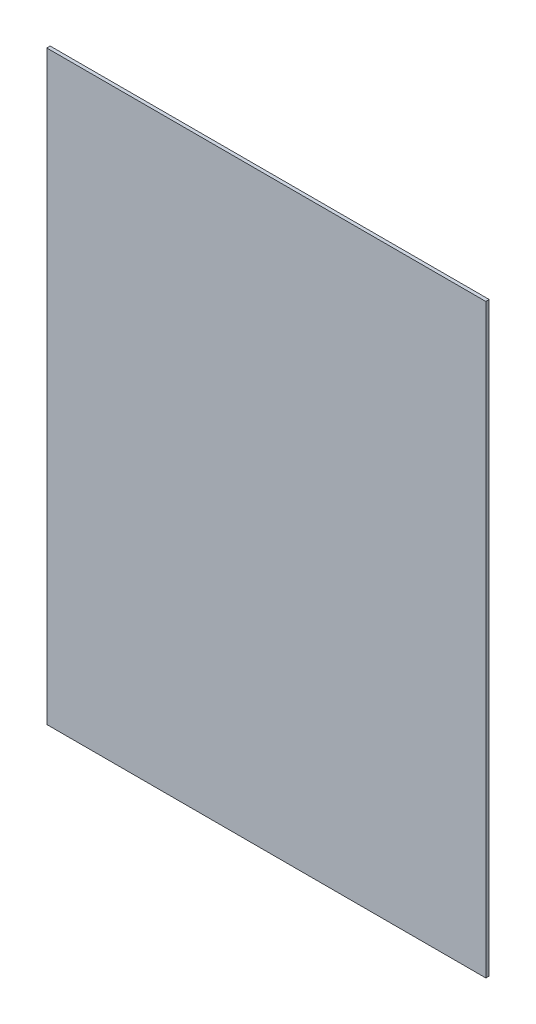
ISO-10303-21;
HEADER;
FILE_DESCRIPTION(('STEP AP214'),'2;1');
FILE_NAME('part.step','',(''),(''),'','','');
FILE_SCHEMA(('AUTOMOTIVE_DESIGN { 1 0 10303 214 1 1 1 1 }'));
ENDSEC;
DATA;
#1=APPLICATION_CONTEXT('core data for automotive mechanical design processes');
#2=APPLICATION_PROTOCOL_DEFINITION('international standard','automotive_design',2000,#1);
#3=PRODUCT_CONTEXT('',#1,'mechanical');
#4=PRODUCT('Part','Part','',(#3));
#5=PRODUCT_RELATED_PRODUCT_CATEGORY('part','',(#4));
#6=PRODUCT_DEFINITION_FORMATION('','',#4);
#7=PRODUCT_DEFINITION_CONTEXT('part definition',#1,'design');
#8=PRODUCT_DEFINITION('design','',#6,#7);
#9=PRODUCT_DEFINITION_SHAPE('','',#8);
#10=(LENGTH_UNIT() NAMED_UNIT(*) SI_UNIT(.MILLI.,.METRE.));
#11=(NAMED_UNIT(*) PLANE_ANGLE_UNIT() SI_UNIT($,.RADIAN.));
#12=(NAMED_UNIT(*) SI_UNIT($,.STERADIAN.) SOLID_ANGLE_UNIT());
#13=UNCERTAINTY_MEASURE_WITH_UNIT(LENGTH_MEASURE(1.E-05),#10,'distance_accuracy_value','');
#14=(GEOMETRIC_REPRESENTATION_CONTEXT(3) GLOBAL_UNCERTAINTY_ASSIGNED_CONTEXT((#13)) GLOBAL_UNIT_ASSIGNED_CONTEXT((#10,
#11,#12)) REPRESENTATION_CONTEXT('',''));
#15=CARTESIAN_POINT('',(0.,0.,0.));
#16=DIRECTION('',(0.,0.,1.));
#17=DIRECTION('',(1.,0.,0.));
#18=AXIS2_PLACEMENT_3D('',#15,#16,#17);
#19=CARTESIAN_POINT('',(77.,-102.75,1.190625));
#20=DIRECTION('',(-1.,0.,0.));
#21=DIRECTION('',(0.,0.,1.));
#22=AXIS2_PLACEMENT_3D('',#19,#20,#21);
#23=PLANE('',#22);
#24=DIRECTION('',(0.,1.,0.));
#25=VECTOR('',#24,1.);
#26=CARTESIAN_POINT('',(77.,-102.75,0.));
#27=LINE('',#26,#25);
#28=CARTESIAN_POINT('',(77.,-102.75,0.));
#29=VERTEX_POINT('',#28);
#30=CARTESIAN_POINT('',(77.,102.75,0.));
#31=VERTEX_POINT('',#30);
#32=EDGE_CURVE('E100',#29,#31,#27,.T.);
#33=ORIENTED_EDGE('',*,*,#32,.T.);
#34=DIRECTION('',(0.,0.,-1.));
#35=VECTOR('',#34,1.);
#36=CARTESIAN_POINT('',(77.,102.75,1.190625));
#37=LINE('',#36,#35);
#38=CARTESIAN_POINT('',(77.,102.75,1.190625));
#39=VERTEX_POINT('',#38);
#40=EDGE_CURVE('E11',#39,#31,#37,.T.);
#41=ORIENTED_EDGE('',*,*,#40,.F.);
#42=DIRECTION('',(0.,1.,0.));
#43=VECTOR('',#42,1.);
#44=CARTESIAN_POINT('',(77.,-102.75,1.190625));
#45=LINE('',#44,#43);
#46=CARTESIAN_POINT('',(77.,-102.75,1.190625));
#47=VERTEX_POINT('',#46);
#48=EDGE_CURVE('E88',#47,#39,#45,.T.);
#49=ORIENTED_EDGE('',*,*,#48,.F.);
#50=DIRECTION('',(0.,0.,-1.));
#51=VECTOR('',#50,1.);
#52=CARTESIAN_POINT('',(77.,-102.75,1.190625));
#53=LINE('',#52,#51);
#54=EDGE_CURVE('E96',#47,#29,#53,.T.);
#55=ORIENTED_EDGE('',*,*,#54,.T.);
#56=EDGE_LOOP('',(#33,#41,#49,#55));
#57=FACE_BOUND('',#56,.T.);
#58=ADVANCED_FACE('F37',(#57),#23,.F.);
#59=CARTESIAN_POINT('',(-77.,102.75,1.190625));
#60=DIRECTION('',(0.,-1.,0.));
#61=DIRECTION('',(0.,0.,-1.));
#62=AXIS2_PLACEMENT_3D('',#59,#60,#61);
#63=PLANE('',#62);
#64=DIRECTION('',(-1.,0.,0.));
#65=VECTOR('',#64,1.);
#66=CARTESIAN_POINT('',(-77.,102.75,0.));
#67=LINE('',#66,#65);
#68=CARTESIAN_POINT('',(-77.,102.75,0.));
#69=VERTEX_POINT('',#68);
#70=EDGE_CURVE('E92',#31,#69,#67,.T.);
#71=ORIENTED_EDGE('',*,*,#70,.T.);
#72=DIRECTION('',(0.,0.,-1.));
#73=VECTOR('',#72,1.);
#74=CARTESIAN_POINT('',(-77.,102.75,1.190625));
#75=LINE('',#74,#73);
#76=CARTESIAN_POINT('',(-77.,102.75,1.190625));
#77=VERTEX_POINT('',#76);
#78=EDGE_CURVE('E45',#77,#69,#75,.T.);
#79=ORIENTED_EDGE('',*,*,#78,.F.);
#80=DIRECTION('',(-1.,0.,0.));
#81=VECTOR('',#80,1.);
#82=CARTESIAN_POINT('',(-77.,102.75,1.190625));
#83=LINE('',#82,#81);
#84=EDGE_CURVE('E83',#39,#77,#83,.T.);
#85=ORIENTED_EDGE('',*,*,#84,.F.);
#86=ORIENTED_EDGE('',*,*,#40,.T.);
#87=EDGE_LOOP('',(#71,#79,#85,#86));
#88=FACE_BOUND('',#87,.T.);
#89=ADVANCED_FACE('F91',(#88),#63,.F.);
#90=CARTESIAN_POINT('',(-77.,-102.75,1.190625));
#91=DIRECTION('',(1.,0.,0.));
#92=DIRECTION('',(0.,0.,-1.));
#93=AXIS2_PLACEMENT_3D('',#90,#91,#92);
#94=PLANE('',#93);
#95=DIRECTION('',(0.,-1.,0.));
#96=VECTOR('',#95,1.);
#97=CARTESIAN_POINT('',(-77.,-102.75,0.));
#98=LINE('',#97,#96);
#99=CARTESIAN_POINT('',(-77.,-102.75,0.));
#100=VERTEX_POINT('',#99);
#101=EDGE_CURVE('E70',#69,#100,#98,.T.);
#102=ORIENTED_EDGE('',*,*,#101,.T.);
#103=DIRECTION('',(0.,0.,-1.));
#104=VECTOR('',#103,1.);
#105=CARTESIAN_POINT('',(-77.,-102.75,1.190625));
#106=LINE('',#105,#104);
#107=CARTESIAN_POINT('',(-77.,-102.75,1.190625));
#108=VERTEX_POINT('',#107);
#109=EDGE_CURVE('E93',#108,#100,#106,.T.);
#110=ORIENTED_EDGE('',*,*,#109,.F.);
#111=DIRECTION('',(0.,-1.,0.));
#112=VECTOR('',#111,1.);
#113=CARTESIAN_POINT('',(-77.,-102.75,1.190625));
#114=LINE('',#113,#112);
#115=EDGE_CURVE('E86',#77,#108,#114,.T.);
#116=ORIENTED_EDGE('',*,*,#115,.F.);
#117=ORIENTED_EDGE('',*,*,#78,.T.);
#118=EDGE_LOOP('',(#102,#110,#116,#117));
#119=FACE_BOUND('',#118,.T.);
#120=ADVANCED_FACE('F94',(#119),#94,.F.);
#121=CARTESIAN_POINT('',(-77.,-102.75,1.190625));
#122=DIRECTION('',(0.,1.,0.));
#123=DIRECTION('',(0.,0.,1.));
#124=AXIS2_PLACEMENT_3D('',#121,#122,#123);
#125=PLANE('',#124);
#126=DIRECTION('',(1.,0.,0.));
#127=VECTOR('',#126,1.);
#128=CARTESIAN_POINT('',(-77.,-102.75,0.));
#129=LINE('',#128,#127);
#130=EDGE_CURVE('E76',#100,#29,#129,.T.);
#131=ORIENTED_EDGE('',*,*,#130,.T.);
#132=ORIENTED_EDGE('',*,*,#54,.F.);
#133=DIRECTION('',(1.,0.,0.));
#134=VECTOR('',#133,1.);
#135=CARTESIAN_POINT('',(-77.,-102.75,1.190625));
#136=LINE('',#135,#134);
#137=EDGE_CURVE('E53',#108,#47,#136,.T.);
#138=ORIENTED_EDGE('',*,*,#137,.F.);
#139=ORIENTED_EDGE('',*,*,#109,.T.);
#140=EDGE_LOOP('',(#131,#132,#138,#139));
#141=FACE_BOUND('',#140,.T.);
#142=ADVANCED_FACE('F107',(#141),#125,.F.);
#143=CARTESIAN_POINT('',(0.,0.,1.190625));
#144=DIRECTION('',(0.,0.,-1.));
#145=DIRECTION('',(-1.,0.,0.));
#146=AXIS2_PLACEMENT_3D('',#143,#144,#145);
#147=PLANE('',#146);
#148=ORIENTED_EDGE('',*,*,#48,.T.);
#149=ORIENTED_EDGE('',*,*,#84,.T.);
#150=ORIENTED_EDGE('',*,*,#115,.T.);
#151=ORIENTED_EDGE('',*,*,#137,.T.);
#152=EDGE_LOOP('',(#148,#149,#150,#151));
#153=FACE_BOUND('',#152,.T.);
#154=ADVANCED_FACE('F84',(#153),#147,.F.);
#155=CARTESIAN_POINT('',(0.,0.,0.));
#156=DIRECTION('',(0.,0.,-1.));
#157=DIRECTION('',(-1.,0.,0.));
#158=AXIS2_PLACEMENT_3D('',#155,#156,#157);
#159=PLANE('',#158);
#160=ORIENTED_EDGE('',*,*,#32,.F.);
#161=ORIENTED_EDGE('',*,*,#130,.F.);
#162=ORIENTED_EDGE('',*,*,#101,.F.);
#163=ORIENTED_EDGE('',*,*,#70,.F.);
#164=EDGE_LOOP('',(#160,#161,#162,#163));
#165=FACE_BOUND('',#164,.T.);
#166=ADVANCED_FACE('F110',(#165),#159,.T.);
#167=CLOSED_SHELL('',(#58,#89,#120,#142,#154,#166));
#168=MANIFOLD_SOLID_BREP('B2',#167);
#169=ADVANCED_BREP_SHAPE_REPRESENTATION('',(#18,#168),#14);
#170=SHAPE_DEFINITION_REPRESENTATION(#9,#169);
ENDSEC;
END-ISO-10303-21;
